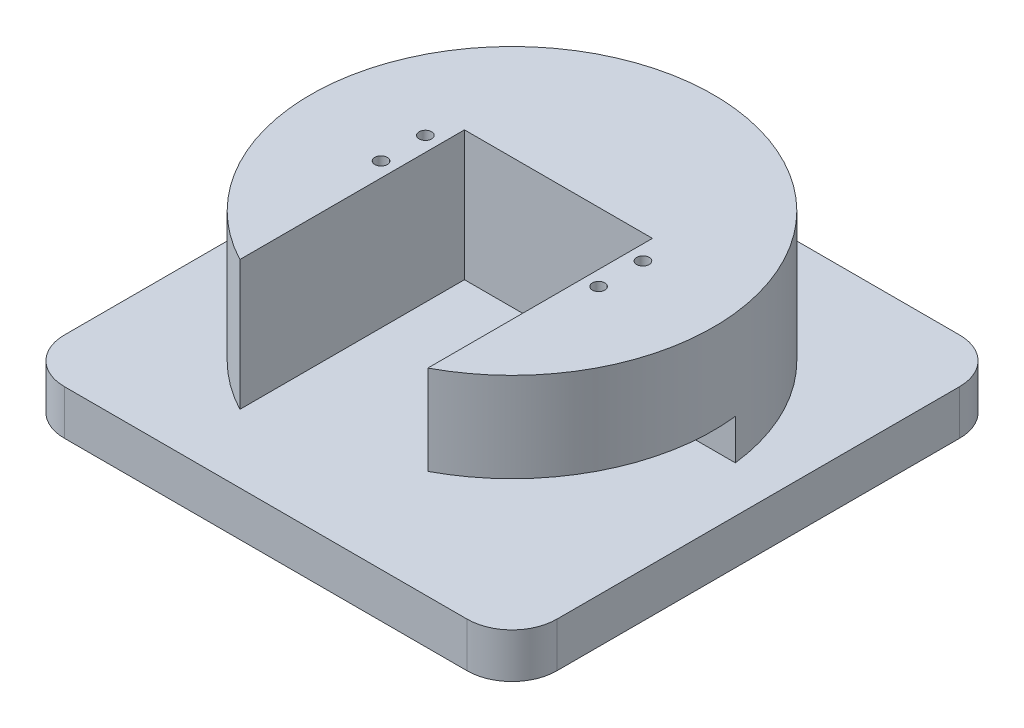
ISO-10303-21;
HEADER;
FILE_DESCRIPTION(('STEP AP214'),'2;1');
FILE_NAME('part.step','',(''),(''),'','','');
FILE_SCHEMA(('AUTOMOTIVE_DESIGN { 1 0 10303 214 1 1 1 1 }'));
ENDSEC;
DATA;
#1=APPLICATION_CONTEXT('core data for automotive mechanical design processes');
#2=APPLICATION_PROTOCOL_DEFINITION('international standard','automotive_design',2000,#1);
#3=PRODUCT_CONTEXT('',#1,'mechanical');
#4=PRODUCT('Part','Part','',(#3));
#5=PRODUCT_RELATED_PRODUCT_CATEGORY('part','',(#4));
#6=PRODUCT_DEFINITION_FORMATION('','',#4);
#7=PRODUCT_DEFINITION_CONTEXT('part definition',#1,'design');
#8=PRODUCT_DEFINITION('design','',#6,#7);
#9=PRODUCT_DEFINITION_SHAPE('','',#8);
#10=(LENGTH_UNIT() NAMED_UNIT(*) SI_UNIT(.MILLI.,.METRE.));
#11=(NAMED_UNIT(*) PLANE_ANGLE_UNIT() SI_UNIT($,.RADIAN.));
#12=(NAMED_UNIT(*) SI_UNIT($,.STERADIAN.) SOLID_ANGLE_UNIT());
#13=UNCERTAINTY_MEASURE_WITH_UNIT(LENGTH_MEASURE(1.E-05),#10,'distance_accuracy_value','');
#14=(GEOMETRIC_REPRESENTATION_CONTEXT(3) GLOBAL_UNCERTAINTY_ASSIGNED_CONTEXT((#13)) GLOBAL_UNIT_ASSIGNED_CONTEXT((#10,
#11,#12)) REPRESENTATION_CONTEXT('',''));
#15=CARTESIAN_POINT('',(0.,0.,0.));
#16=DIRECTION('',(0.,0.,1.));
#17=DIRECTION('',(1.,0.,0.));
#18=AXIS2_PLACEMENT_3D('',#15,#16,#17);
#19=CARTESIAN_POINT('',(0.,29.,0.));
#20=DIRECTION('',(0.,-1.,0.));
#21=DIRECTION('',(0.,0.,-1.));
#22=AXIS2_PLACEMENT_3D('',#19,#20,#21);
#23=CYLINDRICAL_SURFACE('',#22,45.);
#24=DIRECTION('',(0.,-1.,0.));
#25=VECTOR('',#24,1.);
#26=CARTESIAN_POINT('',(21.,29.,39.7994974842648));
#27=LINE('',#26,#25);
#28=CARTESIAN_POINT('',(21.,9.00000000000001,39.7994974842648));
#29=VERTEX_POINT('',#28);
#30=CARTESIAN_POINT('',(21.,29.,39.7994974842648));
#31=VERTEX_POINT('',#30);
#32=EDGE_CURVE('E237',#29,#31,#27,.F.);
#33=ORIENTED_EDGE('',*,*,#32,.F.);
#34=CARTESIAN_POINT('',(0.,8.99999999999999,0.));
#35=DIRECTION('',(0.,1.,0.));
#36=DIRECTION('',(0.,0.,1.));
#37=AXIS2_PLACEMENT_3D('',#34,#35,#36);
#38=CIRCLE('',#37,45.);
#39=CARTESIAN_POINT('',(44.6984873746733,8.99999999999999,-5.20050251573519));
#40=VERTEX_POINT('',#39);
#41=EDGE_CURVE('E55',#29,#40,#38,.T.);
#42=ORIENTED_EDGE('',*,*,#41,.T.);
#43=DIRECTION('',(0.,-1.,0.));
#44=VECTOR('',#43,1.);
#45=CARTESIAN_POINT('',(44.6984873746733,29.,-5.20050251573519));
#46=LINE('',#45,#44);
#47=CARTESIAN_POINT('',(44.6984873746733,0.,-5.20050251573519));
#48=VERTEX_POINT('',#47);
#49=EDGE_CURVE('E150',#40,#48,#46,.T.);
#50=ORIENTED_EDGE('',*,*,#49,.T.);
#51=CARTESIAN_POINT('',(0.,0.,0.));
#52=DIRECTION('',(0.,1.,0.));
#53=DIRECTION('',(0.,0.,1.));
#54=AXIS2_PLACEMENT_3D('',#51,#52,#53);
#55=CIRCLE('',#54,45.);
#56=CARTESIAN_POINT('',(-21.,0.,39.7994974842648));
#57=VERTEX_POINT('',#56);
#58=EDGE_CURVE('E256',#48,#57,#55,.T.);
#59=ORIENTED_EDGE('',*,*,#58,.T.);
#60=DIRECTION('',(0.,-1.,0.));
#61=VECTOR('',#60,1.);
#62=CARTESIAN_POINT('',(-21.,29.,39.7994974842648));
#63=LINE('',#62,#61);
#64=CARTESIAN_POINT('',(-21.,29.,39.7994974842648));
#65=VERTEX_POINT('',#64);
#66=EDGE_CURVE('E233',#57,#65,#63,.F.);
#67=ORIENTED_EDGE('',*,*,#66,.T.);
#68=CARTESIAN_POINT('',(0.,29.,0.));
#69=DIRECTION('',(0.,1.,0.));
#70=DIRECTION('',(0.,0.,1.));
#71=AXIS2_PLACEMENT_3D('',#68,#69,#70);
#72=CIRCLE('',#71,45.);
#73=EDGE_CURVE('E271',#31,#65,#72,.T.);
#74=ORIENTED_EDGE('',*,*,#73,.F.);
#75=EDGE_LOOP('',(#33,#42,#50,#59,#67,#74));
#76=FACE_BOUND('',#75,.T.);
#77=ADVANCED_FACE('F39',(#76),#23,.T.);
#78=CARTESIAN_POINT('',(0.,29.,0.));
#79=DIRECTION('',(0.,1.,0.));
#80=DIRECTION('',(0.,0.,1.));
#81=AXIS2_PLACEMENT_3D('',#78,#79,#80);
#82=PLANE('',#81);
#83=CARTESIAN_POINT('',(24.3,29.,-4.94999999999999));
#84=DIRECTION('',(0.,1.,0.));
#85=DIRECTION('',(0.,0.,1.));
#86=AXIS2_PLACEMENT_3D('',#83,#84,#85);
#87=CIRCLE('',#86,1.4);
#88=CARTESIAN_POINT('',(24.3,29.,-3.54999999999999));
#89=VERTEX_POINT('',#88);
#90=EDGE_CURVE('E190',#89,#89,#87,.T.);
#91=ORIENTED_EDGE('',*,*,#90,.F.);
#92=EDGE_LOOP('',(#91));
#93=FACE_BOUND('',#92,.T.);
#94=CARTESIAN_POINT('',(24.3,29.,4.95000000000001));
#95=DIRECTION('',(0.,1.,0.));
#96=DIRECTION('',(0.,0.,1.));
#97=AXIS2_PLACEMENT_3D('',#94,#95,#96);
#98=CIRCLE('',#97,1.4);
#99=CARTESIAN_POINT('',(24.3,29.,6.35000000000001));
#100=VERTEX_POINT('',#99);
#101=EDGE_CURVE('E182',#100,#100,#98,.T.);
#102=ORIENTED_EDGE('',*,*,#101,.F.);
#103=EDGE_LOOP('',(#102));
#104=FACE_BOUND('',#103,.T.);
#105=CARTESIAN_POINT('',(-24.3,29.,4.95000000000001));
#106=DIRECTION('',(0.,1.,0.));
#107=DIRECTION('',(0.,0.,1.));
#108=AXIS2_PLACEMENT_3D('',#105,#106,#107);
#109=CIRCLE('',#108,1.4);
#110=CARTESIAN_POINT('',(-24.3,29.,6.35000000000001));
#111=VERTEX_POINT('',#110);
#112=EDGE_CURVE('E173',#111,#111,#109,.T.);
#113=ORIENTED_EDGE('',*,*,#112,.F.);
#114=EDGE_LOOP('',(#113));
#115=FACE_BOUND('',#114,.T.);
#116=CARTESIAN_POINT('',(-24.3,29.,-4.94999999999999));
#117=DIRECTION('',(0.,1.,0.));
#118=DIRECTION('',(0.,0.,1.));
#119=AXIS2_PLACEMENT_3D('',#116,#117,#118);
#120=CIRCLE('',#119,1.4);
#121=CARTESIAN_POINT('',(-24.3,29.,-3.54999999999999));
#122=VERTEX_POINT('',#121);
#123=EDGE_CURVE('E177',#122,#122,#120,.T.);
#124=ORIENTED_EDGE('',*,*,#123,.F.);
#125=EDGE_LOOP('',(#124));
#126=FACE_BOUND('',#125,.T.);
#127=DIRECTION('',(1.,0.,0.));
#128=VECTOR('',#127,1.);
#129=CARTESIAN_POINT('',(-21.,29.,-10.3793524444163));
#130=LINE('',#129,#128);
#131=CARTESIAN_POINT('',(-21.,29.,-10.3793524444163));
#132=VERTEX_POINT('',#131);
#133=CARTESIAN_POINT('',(21.,29.,-10.3793524444163));
#134=VERTEX_POINT('',#133);
#135=EDGE_CURVE('E201',#132,#134,#130,.T.);
#136=ORIENTED_EDGE('',*,*,#135,.T.);
#137=DIRECTION('',(0.,0.,1.));
#138=VECTOR('',#137,1.);
#139=CARTESIAN_POINT('',(21.,29.,-10.3793524444163));
#140=LINE('',#139,#138);
#141=EDGE_CURVE('E220',#134,#31,#140,.T.);
#142=ORIENTED_EDGE('',*,*,#141,.T.);
#143=ORIENTED_EDGE('',*,*,#73,.T.);
#144=DIRECTION('',(0.,0.,1.));
#145=VECTOR('',#144,1.);
#146=CARTESIAN_POINT('',(-21.,29.,-10.3793524444163));
#147=LINE('',#146,#145);
#148=EDGE_CURVE('E209',#132,#65,#147,.T.);
#149=ORIENTED_EDGE('',*,*,#148,.F.);
#150=EDGE_LOOP('',(#136,#142,#143,#149));
#151=FACE_BOUND('',#150,.T.);
#152=ADVANCED_FACE('F364',(#93,#104,#115,#126,#151),#82,.T.);
#153=CARTESIAN_POINT('',(-55.,-10.,-55.));
#154=DIRECTION('',(0.,0.,1.));
#155=DIRECTION('',(1.,0.,0.));
#156=AXIS2_PLACEMENT_3D('',#153,#154,#155);
#157=PLANE('',#156);
#158=DIRECTION('',(1.,0.,0.));
#159=VECTOR('',#158,1.);
#160=CARTESIAN_POINT('',(-55.,-10.,-55.));
#161=LINE('',#160,#159);
#162=CARTESIAN_POINT('',(-45.,-10.,-55.));
#163=VERTEX_POINT('',#162);
#164=CARTESIAN_POINT('',(45.,-10.,-55.));
#165=VERTEX_POINT('',#164);
#166=EDGE_CURVE('E241',#163,#165,#161,.T.);
#167=ORIENTED_EDGE('',*,*,#166,.F.);
#168=DIRECTION('',(0.,1.,0.));
#169=VECTOR('',#168,1.);
#170=CARTESIAN_POINT('',(-45.,0.,-55.));
#171=LINE('',#170,#169);
#172=CARTESIAN_POINT('',(-45.,0.,-55.));
#173=VERTEX_POINT('',#172);
#174=EDGE_CURVE('E280',#163,#173,#171,.T.);
#175=ORIENTED_EDGE('',*,*,#174,.T.);
#176=DIRECTION('',(1.,0.,0.));
#177=VECTOR('',#176,1.);
#178=CARTESIAN_POINT('',(-55.,0.,-55.));
#179=LINE('',#178,#177);
#180=CARTESIAN_POINT('',(45.,0.,-55.));
#181=VERTEX_POINT('',#180);
#182=EDGE_CURVE('E240',#173,#181,#179,.T.);
#183=ORIENTED_EDGE('',*,*,#182,.T.);
#184=DIRECTION('',(0.,1.,0.));
#185=VECTOR('',#184,1.);
#186=CARTESIAN_POINT('',(45.,-10.,-55.));
#187=LINE('',#186,#185);
#188=EDGE_CURVE('E275',#181,#165,#187,.F.);
#189=ORIENTED_EDGE('',*,*,#188,.T.);
#190=EDGE_LOOP('',(#167,#175,#183,#189));
#191=FACE_BOUND('',#190,.T.);
#192=ADVANCED_FACE('F344',(#191),#157,.F.);
#193=CARTESIAN_POINT('',(55.,-10.,-55.));
#194=DIRECTION('',(-1.,0.,0.));
#195=DIRECTION('',(0.,0.,1.));
#196=AXIS2_PLACEMENT_3D('',#193,#194,#195);
#197=PLANE('',#196);
#198=DIRECTION('',(0.,0.,1.));
#199=VECTOR('',#198,1.);
#200=CARTESIAN_POINT('',(55.,-10.,-55.));
#201=LINE('',#200,#199);
#202=CARTESIAN_POINT('',(55.,-10.,-45.));
#203=VERTEX_POINT('',#202);
#204=CARTESIAN_POINT('',(55.,-10.,45.));
#205=VERTEX_POINT('',#204);
#206=EDGE_CURVE('E245',#203,#205,#201,.T.);
#207=ORIENTED_EDGE('',*,*,#206,.F.);
#208=DIRECTION('',(0.,1.,0.));
#209=VECTOR('',#208,1.);
#210=CARTESIAN_POINT('',(55.,-10.,-45.));
#211=LINE('',#210,#209);
#212=CARTESIAN_POINT('',(55.,0.,-45.));
#213=VERTEX_POINT('',#212);
#214=EDGE_CURVE('E317',#203,#213,#211,.T.);
#215=ORIENTED_EDGE('',*,*,#214,.T.);
#216=DIRECTION('',(0.,0.,1.));
#217=VECTOR('',#216,1.);
#218=CARTESIAN_POINT('',(55.,0.,-55.));
#219=LINE('',#218,#217);
#220=CARTESIAN_POINT('',(55.,0.,45.));
#221=VERTEX_POINT('',#220);
#222=EDGE_CURVE('E260',#213,#221,#219,.T.);
#223=ORIENTED_EDGE('',*,*,#222,.T.);
#224=DIRECTION('',(0.,1.,0.));
#225=VECTOR('',#224,1.);
#226=CARTESIAN_POINT('',(55.,-10.,45.));
#227=LINE('',#226,#225);
#228=EDGE_CURVE('E314',#221,#205,#227,.F.);
#229=ORIENTED_EDGE('',*,*,#228,.T.);
#230=EDGE_LOOP('',(#207,#215,#223,#229));
#231=FACE_BOUND('',#230,.T.);
#232=ADVANCED_FACE('F353',(#231),#197,.F.);
#233=CARTESIAN_POINT('',(-55.,-10.,55.));
#234=DIRECTION('',(0.,0.,1.));
#235=DIRECTION('',(1.,0.,0.));
#236=AXIS2_PLACEMENT_3D('',#233,#234,#235);
#237=PLANE('',#236);
#238=DIRECTION('',(1.,0.,0.));
#239=VECTOR('',#238,1.);
#240=CARTESIAN_POINT('',(-55.,-10.,55.));
#241=LINE('',#240,#239);
#242=CARTESIAN_POINT('',(-45.,-10.,55.));
#243=VERTEX_POINT('',#242);
#244=CARTESIAN_POINT('',(45.,-10.,55.));
#245=VERTEX_POINT('',#244);
#246=EDGE_CURVE('E249',#243,#245,#241,.T.);
#247=ORIENTED_EDGE('',*,*,#246,.T.);
#248=DIRECTION('',(0.,1.,0.));
#249=VECTOR('',#248,1.);
#250=CARTESIAN_POINT('',(45.,0.,55.));
#251=LINE('',#250,#249);
#252=CARTESIAN_POINT('',(45.,0.,55.));
#253=VERTEX_POINT('',#252);
#254=EDGE_CURVE('E11',#245,#253,#251,.T.);
#255=ORIENTED_EDGE('',*,*,#254,.T.);
#256=DIRECTION('',(1.,0.,0.));
#257=VECTOR('',#256,1.);
#258=CARTESIAN_POINT('',(-55.,0.,55.));
#259=LINE('',#258,#257);
#260=CARTESIAN_POINT('',(-45.,0.,55.));
#261=VERTEX_POINT('',#260);
#262=EDGE_CURVE('E264',#261,#253,#259,.T.);
#263=ORIENTED_EDGE('',*,*,#262,.F.);
#264=DIRECTION('',(0.,1.,0.));
#265=VECTOR('',#264,1.);
#266=CARTESIAN_POINT('',(-45.,-10.,55.));
#267=LINE('',#266,#265);
#268=EDGE_CURVE('E48',#261,#243,#267,.F.);
#269=ORIENTED_EDGE('',*,*,#268,.T.);
#270=EDGE_LOOP('',(#247,#255,#263,#269));
#271=FACE_BOUND('',#270,.T.);
#272=ADVANCED_FACE('F324',(#271),#237,.T.);
#273=CARTESIAN_POINT('',(-55.,-10.,-55.));
#274=DIRECTION('',(-1.,0.,0.));
#275=DIRECTION('',(0.,0.,1.));
#276=AXIS2_PLACEMENT_3D('',#273,#274,#275);
#277=PLANE('',#276);
#278=DIRECTION('',(0.,0.,1.));
#279=VECTOR('',#278,1.);
#280=CARTESIAN_POINT('',(-55.,0.,-55.));
#281=LINE('',#280,#279);
#282=CARTESIAN_POINT('',(-55.,0.,-45.));
#283=VERTEX_POINT('',#282);
#284=CARTESIAN_POINT('',(-55.,0.,45.));
#285=VERTEX_POINT('',#284);
#286=EDGE_CURVE('E246',#283,#285,#281,.T.);
#287=ORIENTED_EDGE('',*,*,#286,.F.);
#288=DIRECTION('',(0.,1.,0.));
#289=VECTOR('',#288,1.);
#290=CARTESIAN_POINT('',(-55.,-10.,-45.));
#291=LINE('',#290,#289);
#292=CARTESIAN_POINT('',(-55.,-10.,-45.));
#293=VERTEX_POINT('',#292);
#294=EDGE_CURVE('E300',#283,#293,#291,.F.);
#295=ORIENTED_EDGE('',*,*,#294,.T.);
#296=DIRECTION('',(0.,0.,1.));
#297=VECTOR('',#296,1.);
#298=CARTESIAN_POINT('',(-55.,-10.,-55.));
#299=LINE('',#298,#297);
#300=CARTESIAN_POINT('',(-55.,-10.,45.));
#301=VERTEX_POINT('',#300);
#302=EDGE_CURVE('E252',#293,#301,#299,.T.);
#303=ORIENTED_EDGE('',*,*,#302,.T.);
#304=DIRECTION('',(0.,1.,0.));
#305=VECTOR('',#304,1.);
#306=CARTESIAN_POINT('',(-55.,-10.,45.));
#307=LINE('',#306,#305);
#308=EDGE_CURVE('E296',#301,#285,#307,.T.);
#309=ORIENTED_EDGE('',*,*,#308,.T.);
#310=EDGE_LOOP('',(#287,#295,#303,#309));
#311=FACE_BOUND('',#310,.T.);
#312=ADVANCED_FACE('F333',(#311),#277,.T.);
#313=CARTESIAN_POINT('',(0.,-10.,0.));
#314=DIRECTION('',(0.,-1.,0.));
#315=DIRECTION('',(0.,0.,-1.));
#316=AXIS2_PLACEMENT_3D('',#313,#314,#315);
#317=PLANE('',#316);
#318=ORIENTED_EDGE('',*,*,#302,.F.);
#319=CARTESIAN_POINT('',(-45.,-10.,-45.));
#320=DIRECTION('',(0.,-1.,0.));
#321=DIRECTION('',(0.,0.,-1.));
#322=AXIS2_PLACEMENT_3D('',#319,#320,#321);
#323=CIRCLE('',#322,10.);
#324=EDGE_CURVE('E311',#293,#163,#323,.T.);
#325=ORIENTED_EDGE('',*,*,#324,.T.);
#326=ORIENTED_EDGE('',*,*,#166,.T.);
#327=CARTESIAN_POINT('',(45.,-10.,-45.));
#328=DIRECTION('',(0.,-1.,0.));
#329=DIRECTION('',(0.,0.,-1.));
#330=AXIS2_PLACEMENT_3D('',#327,#328,#329);
#331=CIRCLE('',#330,10.);
#332=EDGE_CURVE('E308',#165,#203,#331,.T.);
#333=ORIENTED_EDGE('',*,*,#332,.T.);
#334=ORIENTED_EDGE('',*,*,#206,.T.);
#335=CARTESIAN_POINT('',(45.,-10.,45.));
#336=DIRECTION('',(0.,-1.,0.));
#337=DIRECTION('',(0.,0.,-1.));
#338=AXIS2_PLACEMENT_3D('',#335,#336,#337);
#339=CIRCLE('',#338,10.);
#340=EDGE_CURVE('E63',#205,#245,#339,.T.);
#341=ORIENTED_EDGE('',*,*,#340,.T.);
#342=ORIENTED_EDGE('',*,*,#246,.F.);
#343=CARTESIAN_POINT('',(-45.,-10.,45.));
#344=DIRECTION('',(0.,-1.,0.));
#345=DIRECTION('',(0.,0.,-1.));
#346=AXIS2_PLACEMENT_3D('',#343,#344,#345);
#347=CIRCLE('',#346,10.);
#348=EDGE_CURVE('E303',#243,#301,#347,.T.);
#349=ORIENTED_EDGE('',*,*,#348,.T.);
#350=EDGE_LOOP('',(#318,#325,#326,#333,#334,#341,#342,#349));
#351=FACE_BOUND('',#350,.T.);
#352=ADVANCED_FACE('F329',(#351),#317,.T.);
#353=CARTESIAN_POINT('',(0.,0.,0.));
#354=DIRECTION('',(0.,-1.,0.));
#355=DIRECTION('',(0.,0.,-1.));
#356=AXIS2_PLACEMENT_3D('',#353,#354,#355);
#357=PLANE('',#356);
#358=ORIENTED_EDGE('',*,*,#58,.F.);
#359=DIRECTION('',(-1.,0.,0.));
#360=VECTOR('',#359,1.);
#361=CARTESIAN_POINT('',(45.,0.,-5.20050251573519));
#362=LINE('',#361,#360);
#363=CARTESIAN_POINT('',(21.,0.,-5.20050251573519));
#364=VERTEX_POINT('',#363);
#365=EDGE_CURVE('E152',#48,#364,#362,.T.);
#366=ORIENTED_EDGE('',*,*,#365,.T.);
#367=DIRECTION('',(0.,0.,1.));
#368=VECTOR('',#367,1.);
#369=CARTESIAN_POINT('',(21.,0.,-10.3793524444163));
#370=LINE('',#369,#368);
#371=CARTESIAN_POINT('',(21.,0.,-10.3793524444163));
#372=VERTEX_POINT('',#371);
#373=EDGE_CURVE('E162',#372,#364,#370,.T.);
#374=ORIENTED_EDGE('',*,*,#373,.F.);
#375=DIRECTION('',(1.,0.,0.));
#376=VECTOR('',#375,1.);
#377=CARTESIAN_POINT('',(-21.,0.,-10.3793524444163));
#378=LINE('',#377,#376);
#379=CARTESIAN_POINT('',(-21.,0.,-10.3793524444163));
#380=VERTEX_POINT('',#379);
#381=EDGE_CURVE('E205',#380,#372,#378,.T.);
#382=ORIENTED_EDGE('',*,*,#381,.F.);
#383=DIRECTION('',(0.,0.,1.));
#384=VECTOR('',#383,1.);
#385=CARTESIAN_POINT('',(-21.,0.,-10.3793524444163));
#386=LINE('',#385,#384);
#387=EDGE_CURVE('E212',#380,#57,#386,.T.);
#388=ORIENTED_EDGE('',*,*,#387,.T.);
#389=EDGE_LOOP('',(#358,#366,#374,#382,#388));
#390=FACE_BOUND('',#389,.T.);
#391=ORIENTED_EDGE('',*,*,#182,.F.);
#392=CARTESIAN_POINT('',(-45.,0.,-45.));
#393=DIRECTION('',(0.,-1.,0.));
#394=DIRECTION('',(0.,0.,-1.));
#395=AXIS2_PLACEMENT_3D('',#392,#393,#394);
#396=CIRCLE('',#395,10.);
#397=EDGE_CURVE('E293',#173,#283,#396,.F.);
#398=ORIENTED_EDGE('',*,*,#397,.T.);
#399=ORIENTED_EDGE('',*,*,#286,.T.);
#400=CARTESIAN_POINT('',(-45.,0.,45.));
#401=DIRECTION('',(0.,-1.,0.));
#402=DIRECTION('',(0.,0.,-1.));
#403=AXIS2_PLACEMENT_3D('',#400,#401,#402);
#404=CIRCLE('',#403,10.);
#405=EDGE_CURVE('E284',#285,#261,#404,.F.);
#406=ORIENTED_EDGE('',*,*,#405,.T.);
#407=ORIENTED_EDGE('',*,*,#262,.T.);
#408=CARTESIAN_POINT('',(45.,0.,45.));
#409=DIRECTION('',(0.,-1.,0.));
#410=DIRECTION('',(0.,0.,-1.));
#411=AXIS2_PLACEMENT_3D('',#408,#409,#410);
#412=CIRCLE('',#411,10.);
#413=EDGE_CURVE('E287',#253,#221,#412,.F.);
#414=ORIENTED_EDGE('',*,*,#413,.T.);
#415=ORIENTED_EDGE('',*,*,#222,.F.);
#416=CARTESIAN_POINT('',(45.,0.,-45.));
#417=DIRECTION('',(0.,-1.,0.));
#418=DIRECTION('',(0.,0.,-1.));
#419=AXIS2_PLACEMENT_3D('',#416,#417,#418);
#420=CIRCLE('',#419,10.);
#421=EDGE_CURVE('E290',#213,#181,#420,.F.);
#422=ORIENTED_EDGE('',*,*,#421,.T.);
#423=EDGE_LOOP('',(#391,#398,#399,#406,#407,#414,#415,#422));
#424=FACE_BOUND('',#423,.T.);
#425=ADVANCED_FACE('F337',(#390,#424),#357,.F.);
#426=CARTESIAN_POINT('',(21.,0.,-10.3793524444163));
#427=DIRECTION('',(-1.,0.,0.));
#428=DIRECTION('',(0.,0.,1.));
#429=AXIS2_PLACEMENT_3D('',#426,#427,#428);
#430=PLANE('',#429);
#431=DIRECTION('',(0.,-1.,0.));
#432=VECTOR('',#431,1.);
#433=CARTESIAN_POINT('',(21.,0.,-5.20050251573519));
#434=LINE('',#433,#432);
#435=CARTESIAN_POINT('',(21.,8.99999999999999,-5.20050251573519));
#436=VERTEX_POINT('',#435);
#437=EDGE_CURVE('E147',#436,#364,#434,.T.);
#438=ORIENTED_EDGE('',*,*,#437,.F.);
#439=DIRECTION('',(0.,0.,-1.));
#440=VECTOR('',#439,1.);
#441=CARTESIAN_POINT('',(21.,9.,39.7994974842648));
#442=LINE('',#441,#440);
#443=EDGE_CURVE('E154',#29,#436,#442,.T.);
#444=ORIENTED_EDGE('',*,*,#443,.F.);
#445=ORIENTED_EDGE('',*,*,#32,.T.);
#446=ORIENTED_EDGE('',*,*,#141,.F.);
#447=DIRECTION('',(0.,1.,0.));
#448=VECTOR('',#447,1.);
#449=CARTESIAN_POINT('',(21.,0.,-10.3793524444163));
#450=LINE('',#449,#448);
#451=EDGE_CURVE('E229',#372,#134,#450,.T.);
#452=ORIENTED_EDGE('',*,*,#451,.F.);
#453=ORIENTED_EDGE('',*,*,#373,.T.);
#454=EDGE_LOOP('',(#438,#444,#445,#446,#452,#453));
#455=FACE_BOUND('',#454,.T.);
#456=ADVANCED_FACE('F160',(#455),#430,.T.);
#457=CARTESIAN_POINT('',(-21.,0.,-10.3793524444163));
#458=DIRECTION('',(-1.,0.,0.));
#459=DIRECTION('',(0.,0.,1.));
#460=AXIS2_PLACEMENT_3D('',#457,#458,#459);
#461=PLANE('',#460);
#462=ORIENTED_EDGE('',*,*,#387,.F.);
#463=DIRECTION('',(0.,1.,0.));
#464=VECTOR('',#463,1.);
#465=CARTESIAN_POINT('',(-21.,0.,-10.3793524444163));
#466=LINE('',#465,#464);
#467=EDGE_CURVE('E216',#380,#132,#466,.T.);
#468=ORIENTED_EDGE('',*,*,#467,.T.);
#469=ORIENTED_EDGE('',*,*,#148,.T.);
#470=ORIENTED_EDGE('',*,*,#66,.F.);
#471=EDGE_LOOP('',(#462,#468,#469,#470));
#472=FACE_BOUND('',#471,.T.);
#473=ADVANCED_FACE('F400',(#472),#461,.F.);
#474=CARTESIAN_POINT('',(-21.,0.,-10.3793524444163));
#475=DIRECTION('',(0.,0.,1.));
#476=DIRECTION('',(1.,0.,0.));
#477=AXIS2_PLACEMENT_3D('',#474,#475,#476);
#478=PLANE('',#477);
#479=ORIENTED_EDGE('',*,*,#135,.F.);
#480=ORIENTED_EDGE('',*,*,#467,.F.);
#481=ORIENTED_EDGE('',*,*,#381,.T.);
#482=ORIENTED_EDGE('',*,*,#451,.T.);
#483=EDGE_LOOP('',(#479,#480,#481,#482));
#484=FACE_BOUND('',#483,.T.);
#485=ADVANCED_FACE('F398',(#484),#478,.T.);
#486=CARTESIAN_POINT('',(-24.3,21.,-4.94999999999999));
#487=DIRECTION('',(0.,1.,0.));
#488=DIRECTION('',(0.,0.,1.));
#489=AXIS2_PLACEMENT_3D('',#486,#487,#488);
#490=CYLINDRICAL_SURFACE('',#489,1.4);
#491=CARTESIAN_POINT('',(-24.3,21.,-4.94999999999999));
#492=DIRECTION('',(0.,1.,0.));
#493=DIRECTION('',(0.,0.,1.));
#494=AXIS2_PLACEMENT_3D('',#491,#492,#493);
#495=CIRCLE('',#494,1.4);
#496=CARTESIAN_POINT('',(-24.3,21.,-3.54999999999999));
#497=VERTEX_POINT('',#496);
#498=EDGE_CURVE('E197',#497,#497,#495,.T.);
#499=ORIENTED_EDGE('',*,*,#498,.F.);
#500=EDGE_LOOP('',(#499));
#501=FACE_BOUND('',#500,.T.);
#502=ORIENTED_EDGE('',*,*,#123,.T.);
#503=EDGE_LOOP('',(#502));
#504=FACE_BOUND('',#503,.T.);
#505=ADVANCED_FACE('F394',(#501,#504),#490,.F.);
#506=CARTESIAN_POINT('',(-24.3,21.,-4.94999999999999));
#507=DIRECTION('',(0.,1.,0.));
#508=DIRECTION('',(0.,0.,1.));
#509=AXIS2_PLACEMENT_3D('',#506,#507,#508);
#510=PLANE('',#509);
#511=ORIENTED_EDGE('',*,*,#498,.T.);
#512=EDGE_LOOP('',(#511));
#513=FACE_BOUND('',#512,.T.);
#514=ADVANCED_FACE('F390',(#513),#510,.T.);
#515=CARTESIAN_POINT('',(-24.3,21.,4.95000000000001));
#516=DIRECTION('',(0.,1.,0.));
#517=DIRECTION('',(0.,0.,1.));
#518=AXIS2_PLACEMENT_3D('',#515,#516,#517);
#519=CYLINDRICAL_SURFACE('',#518,1.4);
#520=CARTESIAN_POINT('',(-24.3,21.,4.95000000000001));
#521=DIRECTION('',(0.,1.,0.));
#522=DIRECTION('',(0.,0.,1.));
#523=AXIS2_PLACEMENT_3D('',#520,#521,#522);
#524=CIRCLE('',#523,1.4);
#525=CARTESIAN_POINT('',(-24.3,21.,6.35000000000001));
#526=VERTEX_POINT('',#525);
#527=EDGE_CURVE('E178',#526,#526,#524,.T.);
#528=ORIENTED_EDGE('',*,*,#527,.F.);
#529=EDGE_LOOP('',(#528));
#530=FACE_BOUND('',#529,.T.);
#531=ORIENTED_EDGE('',*,*,#112,.T.);
#532=EDGE_LOOP('',(#531));
#533=FACE_BOUND('',#532,.T.);
#534=ADVANCED_FACE('F393',(#530,#533),#519,.F.);
#535=CARTESIAN_POINT('',(-24.3,21.,4.95000000000001));
#536=DIRECTION('',(0.,1.,0.));
#537=DIRECTION('',(0.,0.,1.));
#538=AXIS2_PLACEMENT_3D('',#535,#536,#537);
#539=PLANE('',#538);
#540=ORIENTED_EDGE('',*,*,#527,.T.);
#541=EDGE_LOOP('',(#540));
#542=FACE_BOUND('',#541,.T.);
#543=ADVANCED_FACE('F471',(#542),#539,.T.);
#544=CARTESIAN_POINT('',(24.3,21.,4.95000000000001));
#545=DIRECTION('',(0.,1.,0.));
#546=DIRECTION('',(0.,0.,1.));
#547=AXIS2_PLACEMENT_3D('',#544,#545,#546);
#548=CYLINDRICAL_SURFACE('',#547,1.4);
#549=CARTESIAN_POINT('',(24.3,21.,4.95000000000001));
#550=DIRECTION('',(0.,1.,0.));
#551=DIRECTION('',(0.,0.,1.));
#552=AXIS2_PLACEMENT_3D('',#549,#550,#551);
#553=CIRCLE('',#552,1.4);
#554=CARTESIAN_POINT('',(24.3,21.,6.35000000000001));
#555=VERTEX_POINT('',#554);
#556=EDGE_CURVE('E186',#555,#555,#553,.T.);
#557=ORIENTED_EDGE('',*,*,#556,.F.);
#558=EDGE_LOOP('',(#557));
#559=FACE_BOUND('',#558,.T.);
#560=ORIENTED_EDGE('',*,*,#101,.T.);
#561=EDGE_LOOP('',(#560));
#562=FACE_BOUND('',#561,.T.);
#563=ADVANCED_FACE('F479',(#559,#562),#548,.F.);
#564=CARTESIAN_POINT('',(24.3,21.,4.95000000000001));
#565=DIRECTION('',(0.,1.,0.));
#566=DIRECTION('',(0.,0.,1.));
#567=AXIS2_PLACEMENT_3D('',#564,#565,#566);
#568=PLANE('',#567);
#569=ORIENTED_EDGE('',*,*,#556,.T.);
#570=EDGE_LOOP('',(#569));
#571=FACE_BOUND('',#570,.T.);
#572=ADVANCED_FACE('F385',(#571),#568,.T.);
#573=CARTESIAN_POINT('',(24.3,21.,-4.94999999999999));
#574=DIRECTION('',(0.,1.,0.));
#575=DIRECTION('',(0.,0.,1.));
#576=AXIS2_PLACEMENT_3D('',#573,#574,#575);
#577=CYLINDRICAL_SURFACE('',#576,1.4);
#578=CARTESIAN_POINT('',(24.3,21.,-4.94999999999999));
#579=DIRECTION('',(0.,1.,0.));
#580=DIRECTION('',(0.,0.,1.));
#581=AXIS2_PLACEMENT_3D('',#578,#579,#580);
#582=CIRCLE('',#581,1.4);
#583=CARTESIAN_POINT('',(24.3,21.,-3.54999999999999));
#584=VERTEX_POINT('',#583);
#585=EDGE_CURVE('E172',#584,#584,#582,.T.);
#586=ORIENTED_EDGE('',*,*,#585,.F.);
#587=EDGE_LOOP('',(#586));
#588=FACE_BOUND('',#587,.T.);
#589=ORIENTED_EDGE('',*,*,#90,.T.);
#590=EDGE_LOOP('',(#589));
#591=FACE_BOUND('',#590,.T.);
#592=ADVANCED_FACE('F379',(#588,#591),#577,.F.);
#593=CARTESIAN_POINT('',(24.3,21.,-4.94999999999999));
#594=DIRECTION('',(0.,1.,0.));
#595=DIRECTION('',(0.,0.,1.));
#596=AXIS2_PLACEMENT_3D('',#593,#594,#595);
#597=PLANE('',#596);
#598=ORIENTED_EDGE('',*,*,#585,.T.);
#599=EDGE_LOOP('',(#598));
#600=FACE_BOUND('',#599,.T.);
#601=ADVANCED_FACE('F375',(#600),#597,.T.);
#602=CARTESIAN_POINT('',(-45.,-10.,-45.));
#603=DIRECTION('',(0.,-1.,0.));
#604=DIRECTION('',(0.,0.,-1.));
#605=AXIS2_PLACEMENT_3D('',#602,#603,#604);
#606=CYLINDRICAL_SURFACE('',#605,10.);
#607=ORIENTED_EDGE('',*,*,#324,.F.);
#608=ORIENTED_EDGE('',*,*,#294,.F.);
#609=ORIENTED_EDGE('',*,*,#397,.F.);
#610=ORIENTED_EDGE('',*,*,#174,.F.);
#611=EDGE_LOOP('',(#607,#608,#609,#610));
#612=FACE_BOUND('',#611,.T.);
#613=ADVANCED_FACE('F341',(#612),#606,.T.);
#614=CARTESIAN_POINT('',(45.,-10.,-45.));
#615=DIRECTION('',(0.,1.,0.));
#616=DIRECTION('',(0.,0.,1.));
#617=AXIS2_PLACEMENT_3D('',#614,#615,#616);
#618=CYLINDRICAL_SURFACE('',#617,10.);
#619=ORIENTED_EDGE('',*,*,#332,.F.);
#620=ORIENTED_EDGE('',*,*,#188,.F.);
#621=ORIENTED_EDGE('',*,*,#421,.F.);
#622=ORIENTED_EDGE('',*,*,#214,.F.);
#623=EDGE_LOOP('',(#619,#620,#621,#622));
#624=FACE_BOUND('',#623,.T.);
#625=ADVANCED_FACE('F350',(#624),#618,.T.);
#626=CARTESIAN_POINT('',(45.,-10.,45.));
#627=DIRECTION('',(0.,-1.,0.));
#628=DIRECTION('',(0.,0.,-1.));
#629=AXIS2_PLACEMENT_3D('',#626,#627,#628);
#630=CYLINDRICAL_SURFACE('',#629,10.);
#631=ORIENTED_EDGE('',*,*,#340,.F.);
#632=ORIENTED_EDGE('',*,*,#228,.F.);
#633=ORIENTED_EDGE('',*,*,#413,.F.);
#634=ORIENTED_EDGE('',*,*,#254,.F.);
#635=EDGE_LOOP('',(#631,#632,#633,#634));
#636=FACE_BOUND('',#635,.T.);
#637=ADVANCED_FACE('F356',(#636),#630,.T.);
#638=CARTESIAN_POINT('',(-45.,-10.,45.));
#639=DIRECTION('',(0.,1.,0.));
#640=DIRECTION('',(0.,0.,1.));
#641=AXIS2_PLACEMENT_3D('',#638,#639,#640);
#642=CYLINDRICAL_SURFACE('',#641,10.);
#643=ORIENTED_EDGE('',*,*,#348,.F.);
#644=ORIENTED_EDGE('',*,*,#268,.F.);
#645=ORIENTED_EDGE('',*,*,#405,.F.);
#646=ORIENTED_EDGE('',*,*,#308,.F.);
#647=EDGE_LOOP('',(#643,#644,#645,#646));
#648=FACE_BOUND('',#647,.T.);
#649=ADVANCED_FACE('F41',(#648),#642,.T.);
#650=CARTESIAN_POINT('',(45.,0.,-5.20050251573519));
#651=DIRECTION('',(0.,0.,-1.));
#652=DIRECTION('',(-1.,0.,0.));
#653=AXIS2_PLACEMENT_3D('',#650,#651,#652);
#654=PLANE('',#653);
#655=DIRECTION('',(-1.,0.,0.));
#656=VECTOR('',#655,1.);
#657=CARTESIAN_POINT('',(45.,8.99999999999999,-5.20050251573519));
#658=LINE('',#657,#656);
#659=EDGE_CURVE('E144',#40,#436,#658,.T.);
#660=ORIENTED_EDGE('',*,*,#659,.T.);
#661=ORIENTED_EDGE('',*,*,#437,.T.);
#662=ORIENTED_EDGE('',*,*,#365,.F.);
#663=ORIENTED_EDGE('',*,*,#49,.F.);
#664=EDGE_LOOP('',(#660,#661,#662,#663));
#665=FACE_BOUND('',#664,.T.);
#666=ADVANCED_FACE('F145',(#665),#654,.F.);
#667=CARTESIAN_POINT('',(45.,9.,39.7994974842648));
#668=DIRECTION('',(0.,1.,0.));
#669=DIRECTION('',(0.,0.,1.));
#670=AXIS2_PLACEMENT_3D('',#667,#668,#669);
#671=PLANE('',#670);
#672=ORIENTED_EDGE('',*,*,#443,.T.);
#673=ORIENTED_EDGE('',*,*,#659,.F.);
#674=ORIENTED_EDGE('',*,*,#41,.F.);
#675=EDGE_LOOP('',(#672,#673,#674));
#676=FACE_BOUND('',#675,.T.);
#677=ADVANCED_FACE('F155',(#676),#671,.F.);
#678=CLOSED_SHELL('',(#77,#152,#192,#232,#272,#312,#352,#425,#456,#473,#485,#505,#514,#534,#543,
#563,#572,#592,#601,#613,#625,#637,#649,#666,#677));
#679=MANIFOLD_SOLID_BREP('B2',#678);
#680=ADVANCED_BREP_SHAPE_REPRESENTATION('',(#18,#679),#14);
#681=SHAPE_DEFINITION_REPRESENTATION(#9,#680);
ENDSEC;
END-ISO-10303-21;
